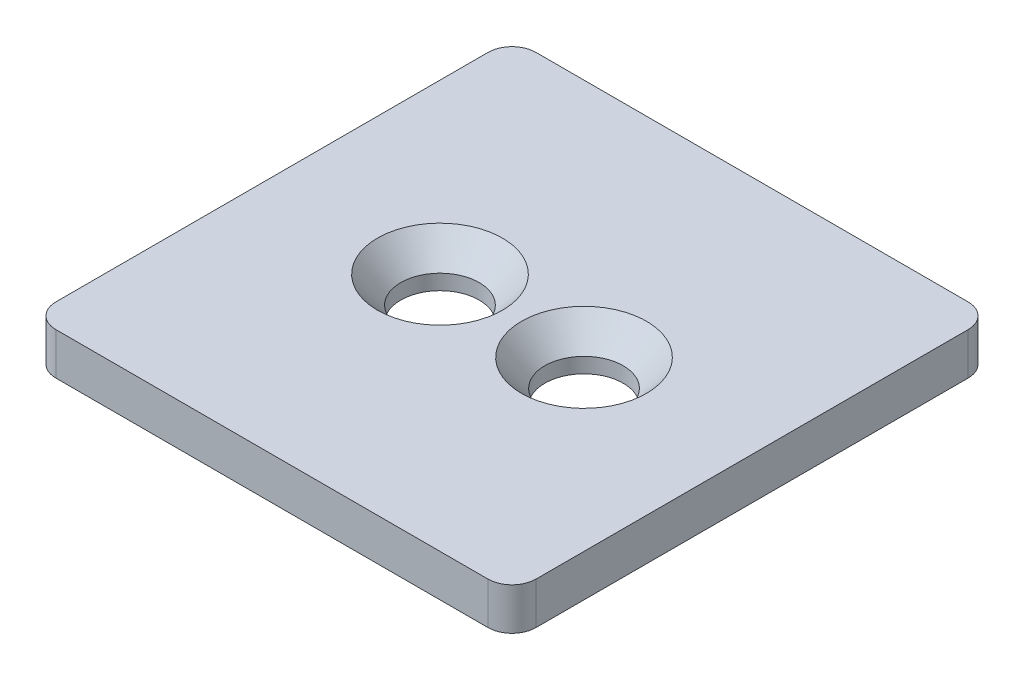
ISO-10303-21;
HEADER;
FILE_DESCRIPTION(('STEP AP214'),'2;1');
FILE_NAME('part.step','',(''),(''),'','','');
FILE_SCHEMA(('AUTOMOTIVE_DESIGN { 1 0 10303 214 1 1 1 1 }'));
ENDSEC;
DATA;
#1=APPLICATION_CONTEXT('core data for automotive mechanical design processes');
#2=APPLICATION_PROTOCOL_DEFINITION('international standard','automotive_design',2000,#1);
#3=PRODUCT_CONTEXT('',#1,'mechanical');
#4=PRODUCT('Part','Part','',(#3));
#5=PRODUCT_RELATED_PRODUCT_CATEGORY('part','',(#4));
#6=PRODUCT_DEFINITION_FORMATION('','',#4);
#7=PRODUCT_DEFINITION_CONTEXT('part definition',#1,'design');
#8=PRODUCT_DEFINITION('design','',#6,#7);
#9=PRODUCT_DEFINITION_SHAPE('','',#8);
#10=(LENGTH_UNIT() NAMED_UNIT(*) SI_UNIT(.MILLI.,.METRE.));
#11=(NAMED_UNIT(*) PLANE_ANGLE_UNIT() SI_UNIT($,.RADIAN.));
#12=(NAMED_UNIT(*) SI_UNIT($,.STERADIAN.) SOLID_ANGLE_UNIT());
#13=UNCERTAINTY_MEASURE_WITH_UNIT(LENGTH_MEASURE(1.E-05),#10,'distance_accuracy_value','');
#14=(GEOMETRIC_REPRESENTATION_CONTEXT(3) GLOBAL_UNCERTAINTY_ASSIGNED_CONTEXT((#13)) GLOBAL_UNIT_ASSIGNED_CONTEXT((#10,
#11,#12)) REPRESENTATION_CONTEXT('',''));
#15=CARTESIAN_POINT('',(0.,0.,0.));
#16=DIRECTION('',(0.,0.,1.));
#17=DIRECTION('',(1.,0.,0.));
#18=AXIS2_PLACEMENT_3D('',#15,#16,#17);
#19=CARTESIAN_POINT('',(10.,1.75,10.));
#20=DIRECTION('',(-1.,0.,0.));
#21=DIRECTION('',(0.,0.,1.));
#22=AXIS2_PLACEMENT_3D('',#19,#20,#21);
#23=PLANE('',#22);
#24=DIRECTION('',(0.,0.,-1.));
#25=VECTOR('',#24,1.);
#26=CARTESIAN_POINT('',(10.,0.,10.));
#27=LINE('',#26,#25);
#28=CARTESIAN_POINT('',(10.,0.,9.));
#29=VERTEX_POINT('',#28);
#30=CARTESIAN_POINT('',(10.,0.,-9.));
#31=VERTEX_POINT('',#30);
#32=EDGE_CURVE('E134',#29,#31,#27,.T.);
#33=ORIENTED_EDGE('',*,*,#32,.T.);
#34=DIRECTION('',(0.,-1.,0.));
#35=VECTOR('',#34,1.);
#36=CARTESIAN_POINT('',(10.,1.75,-9.));
#37=LINE('',#36,#35);
#38=CARTESIAN_POINT('',(10.,1.75,-9.));
#39=VERTEX_POINT('',#38);
#40=EDGE_CURVE('E160',#31,#39,#37,.F.);
#41=ORIENTED_EDGE('',*,*,#40,.T.);
#42=DIRECTION('',(0.,0.,-1.));
#43=VECTOR('',#42,1.);
#44=CARTESIAN_POINT('',(10.,1.75,10.));
#45=LINE('',#44,#43);
#46=CARTESIAN_POINT('',(10.,1.75,9.));
#47=VERTEX_POINT('',#46);
#48=EDGE_CURVE('E135',#47,#39,#45,.T.);
#49=ORIENTED_EDGE('',*,*,#48,.F.);
#50=DIRECTION('',(0.,-1.,0.));
#51=VECTOR('',#50,1.);
#52=CARTESIAN_POINT('',(10.,1.75,9.));
#53=LINE('',#52,#51);
#54=EDGE_CURVE('E152',#47,#29,#53,.T.);
#55=ORIENTED_EDGE('',*,*,#54,.T.);
#56=EDGE_LOOP('',(#33,#41,#49,#55));
#57=FACE_BOUND('',#56,.T.);
#58=ADVANCED_FACE('F39',(#57),#23,.F.);
#59=CARTESIAN_POINT('',(-10.,1.75,-10.));
#60=DIRECTION('',(0.,0.,1.));
#61=DIRECTION('',(1.,0.,0.));
#62=AXIS2_PLACEMENT_3D('',#59,#60,#61);
#63=PLANE('',#62);
#64=DIRECTION('',(-1.,0.,0.));
#65=VECTOR('',#64,1.);
#66=CARTESIAN_POINT('',(-10.,0.,-10.));
#67=LINE('',#66,#65);
#68=CARTESIAN_POINT('',(9.,0.,-10.));
#69=VERTEX_POINT('',#68);
#70=CARTESIAN_POINT('',(-9.,0.,-10.));
#71=VERTEX_POINT('',#70);
#72=EDGE_CURVE('E128',#69,#71,#67,.T.);
#73=ORIENTED_EDGE('',*,*,#72,.T.);
#74=DIRECTION('',(0.,-1.,0.));
#75=VECTOR('',#74,1.);
#76=CARTESIAN_POINT('',(-9.,1.75,-10.));
#77=LINE('',#76,#75);
#78=CARTESIAN_POINT('',(-9.,1.75,-10.));
#79=VERTEX_POINT('',#78);
#80=EDGE_CURVE('E108',#71,#79,#77,.F.);
#81=ORIENTED_EDGE('',*,*,#80,.T.);
#82=DIRECTION('',(-1.,0.,0.));
#83=VECTOR('',#82,1.);
#84=CARTESIAN_POINT('',(-10.,1.75,-10.));
#85=LINE('',#84,#83);
#86=CARTESIAN_POINT('',(9.,1.75,-10.));
#87=VERTEX_POINT('',#86);
#88=EDGE_CURVE('E171',#87,#79,#85,.T.);
#89=ORIENTED_EDGE('',*,*,#88,.F.);
#90=DIRECTION('',(0.,-1.,0.));
#91=VECTOR('',#90,1.);
#92=CARTESIAN_POINT('',(9.,1.75,-10.));
#93=LINE('',#92,#91);
#94=EDGE_CURVE('E111',#87,#69,#93,.T.);
#95=ORIENTED_EDGE('',*,*,#94,.T.);
#96=EDGE_LOOP('',(#73,#81,#89,#95));
#97=FACE_BOUND('',#96,.T.);
#98=ADVANCED_FACE('F213',(#97),#63,.F.);
#99=CARTESIAN_POINT('',(-10.,1.75,10.));
#100=DIRECTION('',(1.,0.,0.));
#101=DIRECTION('',(0.,0.,-1.));
#102=AXIS2_PLACEMENT_3D('',#99,#100,#101);
#103=PLANE('',#102);
#104=DIRECTION('',(0.,0.,1.));
#105=VECTOR('',#104,1.);
#106=CARTESIAN_POINT('',(-10.,1.75,10.));
#107=LINE('',#106,#105);
#108=CARTESIAN_POINT('',(-10.,1.75,-9.));
#109=VERTEX_POINT('',#108);
#110=CARTESIAN_POINT('',(-10.,1.75,9.));
#111=VERTEX_POINT('',#110);
#112=EDGE_CURVE('E124',#109,#111,#107,.T.);
#113=ORIENTED_EDGE('',*,*,#112,.F.);
#114=DIRECTION('',(0.,-1.,0.));
#115=VECTOR('',#114,1.);
#116=CARTESIAN_POINT('',(-10.,1.75,-9.));
#117=LINE('',#116,#115);
#118=CARTESIAN_POINT('',(-10.,0.,-9.));
#119=VERTEX_POINT('',#118);
#120=EDGE_CURVE('E107',#109,#119,#117,.T.);
#121=ORIENTED_EDGE('',*,*,#120,.T.);
#122=DIRECTION('',(0.,0.,1.));
#123=VECTOR('',#122,1.);
#124=CARTESIAN_POINT('',(-10.,0.,10.));
#125=LINE('',#124,#123);
#126=CARTESIAN_POINT('',(-10.,0.,9.));
#127=VERTEX_POINT('',#126);
#128=EDGE_CURVE('E122',#119,#127,#125,.T.);
#129=ORIENTED_EDGE('',*,*,#128,.T.);
#130=DIRECTION('',(0.,-1.,0.));
#131=VECTOR('',#130,1.);
#132=CARTESIAN_POINT('',(-10.,1.75,9.));
#133=LINE('',#132,#131);
#134=EDGE_CURVE('E123',#127,#111,#133,.F.);
#135=ORIENTED_EDGE('',*,*,#134,.T.);
#136=EDGE_LOOP('',(#113,#121,#129,#135));
#137=FACE_BOUND('',#136,.T.);
#138=ADVANCED_FACE('F117',(#137),#103,.F.);
#139=CARTESIAN_POINT('',(-10.,1.75,10.));
#140=DIRECTION('',(0.,0.,-1.));
#141=DIRECTION('',(-1.,0.,0.));
#142=AXIS2_PLACEMENT_3D('',#139,#140,#141);
#143=PLANE('',#142);
#144=DIRECTION('',(1.,0.,0.));
#145=VECTOR('',#144,1.);
#146=CARTESIAN_POINT('',(-10.,0.,10.));
#147=LINE('',#146,#145);
#148=CARTESIAN_POINT('',(-9.,0.,10.));
#149=VERTEX_POINT('',#148);
#150=CARTESIAN_POINT('',(9.,0.,10.));
#151=VERTEX_POINT('',#150);
#152=EDGE_CURVE('E129',#149,#151,#147,.T.);
#153=ORIENTED_EDGE('',*,*,#152,.T.);
#154=DIRECTION('',(0.,-1.,0.));
#155=VECTOR('',#154,1.);
#156=CARTESIAN_POINT('',(9.,1.75,10.));
#157=LINE('',#156,#155);
#158=CARTESIAN_POINT('',(9.,1.75,10.));
#159=VERTEX_POINT('',#158);
#160=EDGE_CURVE('E11',#151,#159,#157,.F.);
#161=ORIENTED_EDGE('',*,*,#160,.T.);
#162=DIRECTION('',(1.,0.,0.));
#163=VECTOR('',#162,1.);
#164=CARTESIAN_POINT('',(-10.,1.75,10.));
#165=LINE('',#164,#163);
#166=CARTESIAN_POINT('',(-9.,1.75,10.));
#167=VERTEX_POINT('',#166);
#168=EDGE_CURVE('E139',#167,#159,#165,.T.);
#169=ORIENTED_EDGE('',*,*,#168,.F.);
#170=DIRECTION('',(0.,-1.,0.));
#171=VECTOR('',#170,1.);
#172=CARTESIAN_POINT('',(-9.,1.75,10.));
#173=LINE('',#172,#171);
#174=EDGE_CURVE('E50',#167,#149,#173,.T.);
#175=ORIENTED_EDGE('',*,*,#174,.T.);
#176=EDGE_LOOP('',(#153,#161,#169,#175));
#177=FACE_BOUND('',#176,.T.);
#178=ADVANCED_FACE('F159',(#177),#143,.F.);
#179=CARTESIAN_POINT('',(0.,1.75,0.));
#180=DIRECTION('',(0.,-1.,0.));
#181=DIRECTION('',(0.,0.,-1.));
#182=AXIS2_PLACEMENT_3D('',#179,#180,#181);
#183=PLANE('',#182);
#184=CARTESIAN_POINT('',(-3.,1.75,0.));
#185=DIRECTION('',(0.,1.,0.));
#186=DIRECTION('',(0.,0.,1.));
#187=AXIS2_PLACEMENT_3D('',#184,#185,#186);
#188=CIRCLE('',#187,2.6035);
#189=CARTESIAN_POINT('',(-3.,1.75,2.6035));
#190=VERTEX_POINT('',#189);
#191=EDGE_CURVE('E200',#190,#190,#188,.T.);
#192=ORIENTED_EDGE('',*,*,#191,.F.);
#193=EDGE_LOOP('',(#192));
#194=FACE_BOUND('',#193,.T.);
#195=CARTESIAN_POINT('',(3.,1.75,0.));
#196=DIRECTION('',(0.,1.,0.));
#197=DIRECTION('',(0.,0.,1.));
#198=AXIS2_PLACEMENT_3D('',#195,#196,#197);
#199=CIRCLE('',#198,2.6035);
#200=CARTESIAN_POINT('',(3.,1.75,2.6035));
#201=VERTEX_POINT('',#200);
#202=EDGE_CURVE('E190',#201,#201,#199,.T.);
#203=ORIENTED_EDGE('',*,*,#202,.F.);
#204=EDGE_LOOP('',(#203));
#205=FACE_BOUND('',#204,.T.);
#206=ORIENTED_EDGE('',*,*,#88,.T.);
#207=CARTESIAN_POINT('',(-9.,1.75,-9.));
#208=DIRECTION('',(0.,-1.,0.));
#209=DIRECTION('',(0.,0.,-1.));
#210=AXIS2_PLACEMENT_3D('',#207,#208,#209);
#211=CIRCLE('',#210,1.);
#212=EDGE_CURVE('E155',#79,#109,#211,.F.);
#213=ORIENTED_EDGE('',*,*,#212,.T.);
#214=ORIENTED_EDGE('',*,*,#112,.T.);
#215=CARTESIAN_POINT('',(-9.,1.75,9.));
#216=DIRECTION('',(0.,-1.,0.));
#217=DIRECTION('',(0.,0.,-1.));
#218=AXIS2_PLACEMENT_3D('',#215,#216,#217);
#219=CIRCLE('',#218,1.);
#220=EDGE_CURVE('E56',#111,#167,#219,.F.);
#221=ORIENTED_EDGE('',*,*,#220,.T.);
#222=ORIENTED_EDGE('',*,*,#168,.T.);
#223=CARTESIAN_POINT('',(9.,1.75,9.));
#224=DIRECTION('',(0.,-1.,0.));
#225=DIRECTION('',(0.,0.,-1.));
#226=AXIS2_PLACEMENT_3D('',#223,#224,#225);
#227=CIRCLE('',#226,1.);
#228=EDGE_CURVE('E146',#159,#47,#227,.F.);
#229=ORIENTED_EDGE('',*,*,#228,.T.);
#230=ORIENTED_EDGE('',*,*,#48,.T.);
#231=CARTESIAN_POINT('',(9.,1.75,-9.));
#232=DIRECTION('',(0.,-1.,0.));
#233=DIRECTION('',(0.,0.,-1.));
#234=AXIS2_PLACEMENT_3D('',#231,#232,#233);
#235=CIRCLE('',#234,1.);
#236=EDGE_CURVE('E147',#39,#87,#235,.F.);
#237=ORIENTED_EDGE('',*,*,#236,.T.);
#238=EDGE_LOOP('',(#206,#213,#214,#221,#222,#229,#230,#237));
#239=FACE_BOUND('',#238,.T.);
#240=ADVANCED_FACE('F202',(#194,#205,#239),#183,.F.);
#241=CARTESIAN_POINT('',(0.,0.,0.));
#242=DIRECTION('',(0.,-1.,0.));
#243=DIRECTION('',(0.,0.,-1.));
#244=AXIS2_PLACEMENT_3D('',#241,#242,#243);
#245=PLANE('',#244);
#246=CARTESIAN_POINT('',(-3.,0.,0.));
#247=DIRECTION('',(0.,1.,0.));
#248=DIRECTION('',(0.,0.,1.));
#249=AXIS2_PLACEMENT_3D('',#246,#247,#248);
#250=CIRCLE('',#249,1.63195);
#251=CARTESIAN_POINT('',(-3.,0.,1.63195));
#252=VERTEX_POINT('',#251);
#253=EDGE_CURVE('E192',#252,#252,#250,.T.);
#254=ORIENTED_EDGE('',*,*,#253,.T.);
#255=EDGE_LOOP('',(#254));
#256=FACE_BOUND('',#255,.T.);
#257=CARTESIAN_POINT('',(3.,0.,0.));
#258=DIRECTION('',(0.,1.,0.));
#259=DIRECTION('',(0.,0.,1.));
#260=AXIS2_PLACEMENT_3D('',#257,#258,#259);
#261=CIRCLE('',#260,1.63195);
#262=CARTESIAN_POINT('',(3.,0.,1.63195));
#263=VERTEX_POINT('',#262);
#264=EDGE_CURVE('E179',#263,#263,#261,.T.);
#265=ORIENTED_EDGE('',*,*,#264,.T.);
#266=EDGE_LOOP('',(#265));
#267=FACE_BOUND('',#266,.T.);
#268=ORIENTED_EDGE('',*,*,#128,.F.);
#269=CARTESIAN_POINT('',(-9.,0.,-9.));
#270=DIRECTION('',(0.,-1.,0.));
#271=DIRECTION('',(0.,0.,-1.));
#272=AXIS2_PLACEMENT_3D('',#269,#270,#271);
#273=CIRCLE('',#272,1.);
#274=EDGE_CURVE('E102',#119,#71,#273,.T.);
#275=ORIENTED_EDGE('',*,*,#274,.T.);
#276=ORIENTED_EDGE('',*,*,#72,.F.);
#277=CARTESIAN_POINT('',(9.,0.,-9.));
#278=DIRECTION('',(0.,-1.,0.));
#279=DIRECTION('',(0.,0.,-1.));
#280=AXIS2_PLACEMENT_3D('',#277,#278,#279);
#281=CIRCLE('',#280,1.);
#282=EDGE_CURVE('E113',#69,#31,#281,.T.);
#283=ORIENTED_EDGE('',*,*,#282,.T.);
#284=ORIENTED_EDGE('',*,*,#32,.F.);
#285=CARTESIAN_POINT('',(9.,0.,9.));
#286=DIRECTION('',(0.,-1.,0.));
#287=DIRECTION('',(0.,0.,-1.));
#288=AXIS2_PLACEMENT_3D('',#285,#286,#287);
#289=CIRCLE('',#288,1.);
#290=EDGE_CURVE('E143',#29,#151,#289,.T.);
#291=ORIENTED_EDGE('',*,*,#290,.T.);
#292=ORIENTED_EDGE('',*,*,#152,.F.);
#293=CARTESIAN_POINT('',(-9.,0.,9.));
#294=DIRECTION('',(0.,-1.,0.));
#295=DIRECTION('',(0.,0.,-1.));
#296=AXIS2_PLACEMENT_3D('',#293,#294,#295);
#297=CIRCLE('',#296,1.);
#298=EDGE_CURVE('E121',#149,#127,#297,.T.);
#299=ORIENTED_EDGE('',*,*,#298,.T.);
#300=EDGE_LOOP('',(#268,#275,#276,#283,#284,#291,#292,#299));
#301=FACE_BOUND('',#300,.T.);
#302=ADVANCED_FACE('F130',(#256,#267,#301),#245,.T.);
#303=CARTESIAN_POINT('',(3.,1.75,0.));
#304=DIRECTION('',(0.,1.,0.));
#305=DIRECTION('',(0.,0.,1.));
#306=AXIS2_PLACEMENT_3D('',#303,#304,#305);
#307=CYLINDRICAL_SURFACE('',#306,1.63195);
#308=ORIENTED_EDGE('',*,*,#264,.F.);
#309=EDGE_LOOP('',(#308));
#310=FACE_BOUND('',#309,.T.);
#311=CARTESIAN_POINT('',(3.,0.632359573964428,0.));
#312=DIRECTION('',(0.,1.,0.));
#313=DIRECTION('',(0.,0.,1.));
#314=AXIS2_PLACEMENT_3D('',#311,#312,#313);
#315=CIRCLE('',#314,1.63195);
#316=CARTESIAN_POINT('',(3.,0.632359573964428,1.63195));
#317=VERTEX_POINT('',#316);
#318=EDGE_CURVE('E181',#317,#317,#315,.T.);
#319=ORIENTED_EDGE('',*,*,#318,.T.);
#320=EDGE_LOOP('',(#319));
#321=FACE_BOUND('',#320,.T.);
#322=ADVANCED_FACE('F237',(#310,#321),#307,.F.);
#323=CARTESIAN_POINT('',(3.,1.75,0.));
#324=DIRECTION('',(0.,1.,0.));
#325=DIRECTION('',(0.,0.,1.));
#326=AXIS2_PLACEMENT_3D('',#323,#324,#325);
#327=CONICAL_SURFACE('',#326,2.6035,0.715584993317675);
#328=ORIENTED_EDGE('',*,*,#318,.F.);
#329=EDGE_LOOP('',(#328));
#330=FACE_BOUND('',#329,.T.);
#331=ORIENTED_EDGE('',*,*,#202,.T.);
#332=EDGE_LOOP('',(#331));
#333=FACE_BOUND('',#332,.T.);
#334=ADVANCED_FACE('F243',(#330,#333),#327,.F.);
#335=CARTESIAN_POINT('',(-3.,1.75,0.));
#336=DIRECTION('',(0.,1.,0.));
#337=DIRECTION('',(0.,0.,1.));
#338=AXIS2_PLACEMENT_3D('',#335,#336,#337);
#339=CYLINDRICAL_SURFACE('',#338,1.63195);
#340=ORIENTED_EDGE('',*,*,#253,.F.);
#341=EDGE_LOOP('',(#340));
#342=FACE_BOUND('',#341,.T.);
#343=CARTESIAN_POINT('',(-3.,0.632359573964428,0.));
#344=DIRECTION('',(0.,1.,0.));
#345=DIRECTION('',(0.,0.,1.));
#346=AXIS2_PLACEMENT_3D('',#343,#344,#345);
#347=CIRCLE('',#346,1.63195);
#348=CARTESIAN_POINT('',(-3.,0.632359573964428,1.63195));
#349=VERTEX_POINT('',#348);
#350=EDGE_CURVE('E198',#349,#349,#347,.T.);
#351=ORIENTED_EDGE('',*,*,#350,.T.);
#352=EDGE_LOOP('',(#351));
#353=FACE_BOUND('',#352,.T.);
#354=ADVANCED_FACE('F242',(#342,#353),#339,.F.);
#355=CARTESIAN_POINT('',(-3.,1.75,0.));
#356=DIRECTION('',(0.,1.,0.));
#357=DIRECTION('',(0.,0.,1.));
#358=AXIS2_PLACEMENT_3D('',#355,#356,#357);
#359=CONICAL_SURFACE('',#358,2.6035,0.715584993317675);
#360=ORIENTED_EDGE('',*,*,#350,.F.);
#361=EDGE_LOOP('',(#360));
#362=FACE_BOUND('',#361,.T.);
#363=ORIENTED_EDGE('',*,*,#191,.T.);
#364=EDGE_LOOP('',(#363));
#365=FACE_BOUND('',#364,.T.);
#366=ADVANCED_FACE('F201',(#362,#365),#359,.F.);
#367=CARTESIAN_POINT('',(-9.,1.75,-9.));
#368=DIRECTION('',(0.,-1.,0.));
#369=DIRECTION('',(0.,0.,-1.));
#370=AXIS2_PLACEMENT_3D('',#367,#368,#369);
#371=CYLINDRICAL_SURFACE('',#370,1.);
#372=ORIENTED_EDGE('',*,*,#212,.F.);
#373=ORIENTED_EDGE('',*,*,#80,.F.);
#374=ORIENTED_EDGE('',*,*,#274,.F.);
#375=ORIENTED_EDGE('',*,*,#120,.F.);
#376=EDGE_LOOP('',(#372,#373,#374,#375));
#377=FACE_BOUND('',#376,.T.);
#378=ADVANCED_FACE('F110',(#377),#371,.T.);
#379=CARTESIAN_POINT('',(9.,1.75,-9.));
#380=DIRECTION('',(0.,-1.,0.));
#381=DIRECTION('',(0.,0.,-1.));
#382=AXIS2_PLACEMENT_3D('',#379,#380,#381);
#383=CYLINDRICAL_SURFACE('',#382,1.);
#384=ORIENTED_EDGE('',*,*,#236,.F.);
#385=ORIENTED_EDGE('',*,*,#40,.F.);
#386=ORIENTED_EDGE('',*,*,#282,.F.);
#387=ORIENTED_EDGE('',*,*,#94,.F.);
#388=EDGE_LOOP('',(#384,#385,#386,#387));
#389=FACE_BOUND('',#388,.T.);
#390=ADVANCED_FACE('F214',(#389),#383,.T.);
#391=CARTESIAN_POINT('',(9.,1.75,9.));
#392=DIRECTION('',(0.,-1.,0.));
#393=DIRECTION('',(0.,0.,-1.));
#394=AXIS2_PLACEMENT_3D('',#391,#392,#393);
#395=CYLINDRICAL_SURFACE('',#394,1.);
#396=ORIENTED_EDGE('',*,*,#228,.F.);
#397=ORIENTED_EDGE('',*,*,#160,.F.);
#398=ORIENTED_EDGE('',*,*,#290,.F.);
#399=ORIENTED_EDGE('',*,*,#54,.F.);
#400=EDGE_LOOP('',(#396,#397,#398,#399));
#401=FACE_BOUND('',#400,.T.);
#402=ADVANCED_FACE('F170',(#401),#395,.T.);
#403=CARTESIAN_POINT('',(-9.,1.75,9.));
#404=DIRECTION('',(0.,-1.,0.));
#405=DIRECTION('',(0.,0.,-1.));
#406=AXIS2_PLACEMENT_3D('',#403,#404,#405);
#407=CYLINDRICAL_SURFACE('',#406,1.);
#408=ORIENTED_EDGE('',*,*,#220,.F.);
#409=ORIENTED_EDGE('',*,*,#134,.F.);
#410=ORIENTED_EDGE('',*,*,#298,.F.);
#411=ORIENTED_EDGE('',*,*,#174,.F.);
#412=EDGE_LOOP('',(#408,#409,#410,#411));
#413=FACE_BOUND('',#412,.T.);
#414=ADVANCED_FACE('F41',(#413),#407,.T.);
#415=CLOSED_SHELL('',(#58,#98,#138,#178,#240,#302,#322,#334,#354,#366,#378,#390,#402,#414));
#416=MANIFOLD_SOLID_BREP('B2',#415);
#417=ADVANCED_BREP_SHAPE_REPRESENTATION('',(#18,#416),#14);
#418=SHAPE_DEFINITION_REPRESENTATION(#9,#417);
ENDSEC;
END-ISO-10303-21;
